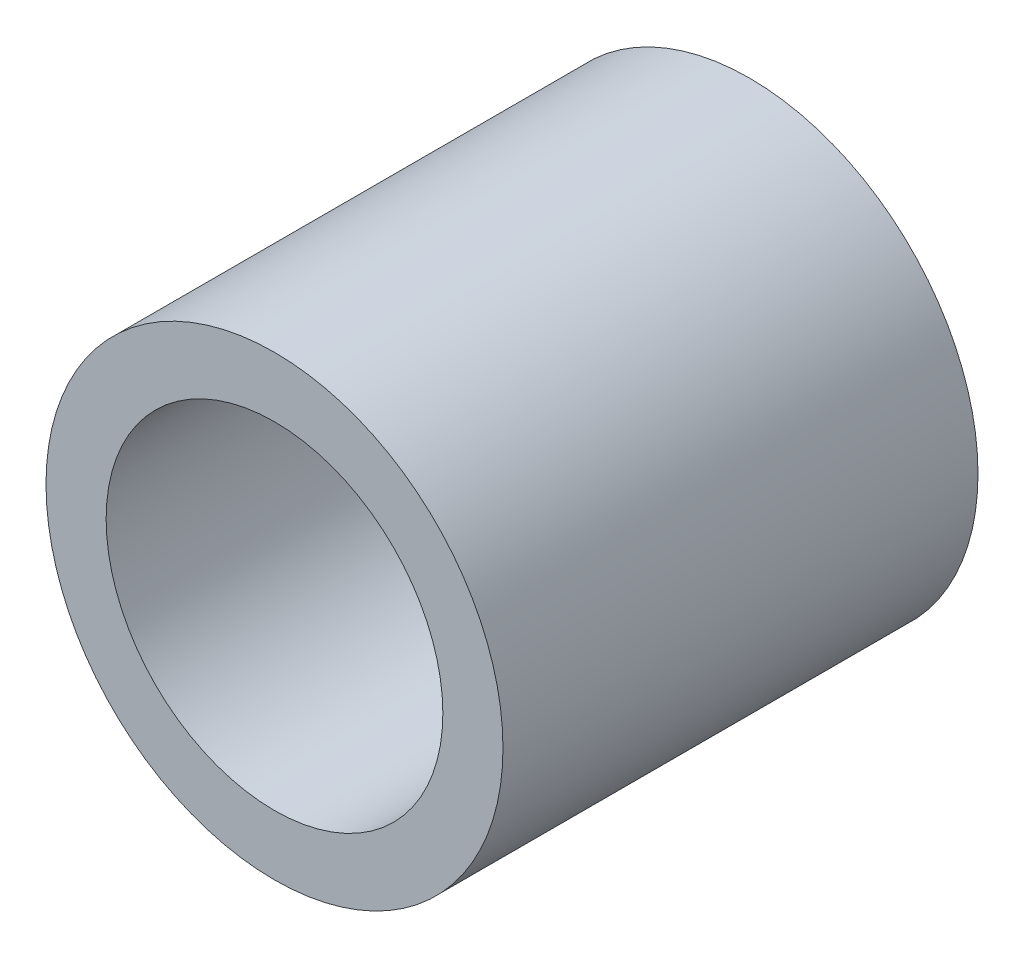
ISO-10303-21;
HEADER;
FILE_DESCRIPTION(('STEP AP214'),'2;1');
FILE_NAME('part.step','',(''),(''),'','','');
FILE_SCHEMA(('AUTOMOTIVE_DESIGN { 1 0 10303 214 1 1 1 1 }'));
ENDSEC;
DATA;
#1=APPLICATION_CONTEXT('core data for automotive mechanical design processes');
#2=APPLICATION_PROTOCOL_DEFINITION('international standard','automotive_design',2000,#1);
#3=PRODUCT_CONTEXT('',#1,'mechanical');
#4=PRODUCT('Part','Part','',(#3));
#5=PRODUCT_RELATED_PRODUCT_CATEGORY('part','',(#4));
#6=PRODUCT_DEFINITION_FORMATION('','',#4);
#7=PRODUCT_DEFINITION_CONTEXT('part definition',#1,'design');
#8=PRODUCT_DEFINITION('design','',#6,#7);
#9=PRODUCT_DEFINITION_SHAPE('','',#8);
#10=(LENGTH_UNIT() NAMED_UNIT(*) SI_UNIT(.MILLI.,.METRE.));
#11=(NAMED_UNIT(*) PLANE_ANGLE_UNIT() SI_UNIT($,.RADIAN.));
#12=(NAMED_UNIT(*) SI_UNIT($,.STERADIAN.) SOLID_ANGLE_UNIT());
#13=UNCERTAINTY_MEASURE_WITH_UNIT(LENGTH_MEASURE(1.E-05),#10,'distance_accuracy_value','');
#14=(GEOMETRIC_REPRESENTATION_CONTEXT(3) GLOBAL_UNCERTAINTY_ASSIGNED_CONTEXT((#13)) GLOBAL_UNIT_ASSIGNED_CONTEXT((#10,
#11,#12)) REPRESENTATION_CONTEXT('',''));
#15=CARTESIAN_POINT('',(0.,0.,0.));
#16=DIRECTION('',(0.,0.,1.));
#17=DIRECTION('',(1.,0.,0.));
#18=AXIS2_PLACEMENT_3D('',#15,#16,#17);
#19=CARTESIAN_POINT('',(0.,0.,10.033));
#20=DIRECTION('',(0.,0.,1.));
#21=DIRECTION('',(1.,0.,0.));
#22=AXIS2_PLACEMENT_3D('',#19,#20,#21);
#23=PLANE('',#22);
#24=CARTESIAN_POINT('',(0.,0.,10.033));
#25=DIRECTION('',(0.,0.,1.));
#26=DIRECTION('',(1.,0.,0.));
#27=AXIS2_PLACEMENT_3D('',#24,#25,#26);
#28=CIRCLE('',#27,4.826);
#29=CARTESIAN_POINT('',(4.826,0.,10.033));
#30=VERTEX_POINT('',#29);
#31=EDGE_CURVE('E10',#30,#30,#28,.T.);
#32=ORIENTED_EDGE('',*,*,#31,.T.);
#33=EDGE_LOOP('',(#32));
#34=FACE_BOUND('',#33,.T.);
#35=CARTESIAN_POINT('',(0.,0.,10.033));
#36=DIRECTION('',(0.,0.,1.));
#37=DIRECTION('',(1.,0.,0.));
#38=AXIS2_PLACEMENT_3D('',#35,#36,#37);
#39=CIRCLE('',#38,3.556);
#40=CARTESIAN_POINT('',(3.556,0.,10.033));
#41=VERTEX_POINT('',#40);
#42=EDGE_CURVE('E42',#41,#41,#39,.T.);
#43=ORIENTED_EDGE('',*,*,#42,.F.);
#44=EDGE_LOOP('',(#43));
#45=FACE_BOUND('',#44,.T.);
#46=ADVANCED_FACE('F31',(#34,#45),#23,.T.);
#47=CARTESIAN_POINT('',(0.,0.,0.));
#48=DIRECTION('',(0.,0.,1.));
#49=DIRECTION('',(1.,0.,0.));
#50=AXIS2_PLACEMENT_3D('',#47,#48,#49);
#51=PLANE('',#50);
#52=CARTESIAN_POINT('',(0.,0.,0.));
#53=DIRECTION('',(0.,0.,1.));
#54=DIRECTION('',(1.,0.,0.));
#55=AXIS2_PLACEMENT_3D('',#52,#53,#54);
#56=CIRCLE('',#55,4.826);
#57=CARTESIAN_POINT('',(4.826,0.,0.));
#58=VERTEX_POINT('',#57);
#59=EDGE_CURVE('E35',#58,#58,#56,.T.);
#60=ORIENTED_EDGE('',*,*,#59,.F.);
#61=EDGE_LOOP('',(#60));
#62=FACE_BOUND('',#61,.T.);
#63=CARTESIAN_POINT('',(0.,0.,0.));
#64=DIRECTION('',(0.,0.,1.));
#65=DIRECTION('',(1.,0.,0.));
#66=AXIS2_PLACEMENT_3D('',#63,#64,#65);
#67=CIRCLE('',#66,3.556);
#68=CARTESIAN_POINT('',(3.556,0.,0.));
#69=VERTEX_POINT('',#68);
#70=EDGE_CURVE('E44',#69,#69,#67,.T.);
#71=ORIENTED_EDGE('',*,*,#70,.T.);
#72=EDGE_LOOP('',(#71));
#73=FACE_BOUND('',#72,.T.);
#74=ADVANCED_FACE('F54',(#62,#73),#51,.F.);
#75=CARTESIAN_POINT('',(0.,0.,10.033));
#76=DIRECTION('',(0.,0.,-1.));
#77=DIRECTION('',(-1.,0.,0.));
#78=AXIS2_PLACEMENT_3D('',#75,#76,#77);
#79=CYLINDRICAL_SURFACE('',#78,4.826);
#80=ORIENTED_EDGE('',*,*,#31,.F.);
#81=EDGE_LOOP('',(#80));
#82=FACE_BOUND('',#81,.T.);
#83=ORIENTED_EDGE('',*,*,#59,.T.);
#84=EDGE_LOOP('',(#83));
#85=FACE_BOUND('',#84,.T.);
#86=ADVANCED_FACE('F33',(#82,#85),#79,.T.);
#87=CARTESIAN_POINT('',(0.,0.,10.033));
#88=DIRECTION('',(0.,0.,-1.));
#89=DIRECTION('',(-1.,0.,0.));
#90=AXIS2_PLACEMENT_3D('',#87,#88,#89);
#91=CYLINDRICAL_SURFACE('',#90,3.556);
#92=ORIENTED_EDGE('',*,*,#42,.T.);
#93=EDGE_LOOP('',(#92));
#94=FACE_BOUND('',#93,.T.);
#95=ORIENTED_EDGE('',*,*,#70,.F.);
#96=EDGE_LOOP('',(#95));
#97=FACE_BOUND('',#96,.T.);
#98=ADVANCED_FACE('F50',(#94,#97),#91,.F.);
#99=CLOSED_SHELL('',(#46,#74,#86,#98));
#100=MANIFOLD_SOLID_BREP('B2',#99);
#101=ADVANCED_BREP_SHAPE_REPRESENTATION('',(#18,#100),#14);
#102=SHAPE_DEFINITION_REPRESENTATION(#9,#101);
ENDSEC;
END-ISO-10303-21;
